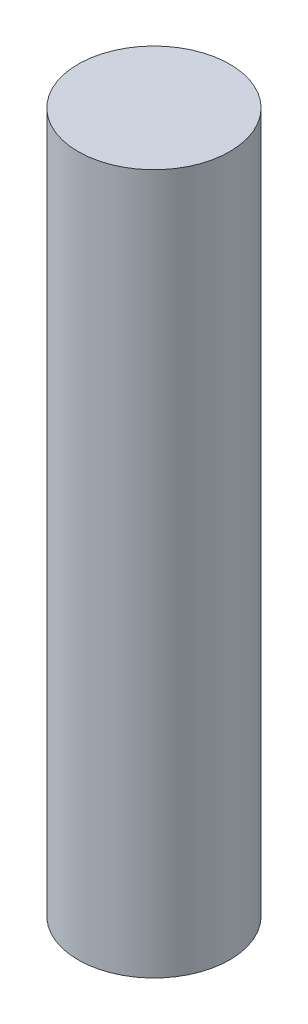
ISO-10303-21;
HEADER;
FILE_DESCRIPTION(('STEP AP214'),'2;1');
FILE_NAME('part.step','',(''),(''),'','','');
FILE_SCHEMA(('AUTOMOTIVE_DESIGN { 1 0 10303 214 1 1 1 1 }'));
ENDSEC;
DATA;
#1=APPLICATION_CONTEXT('core data for automotive mechanical design processes');
#2=APPLICATION_PROTOCOL_DEFINITION('international standard','automotive_design',2000,#1);
#3=PRODUCT_CONTEXT('',#1,'mechanical');
#4=PRODUCT('Part','Part','',(#3));
#5=PRODUCT_RELATED_PRODUCT_CATEGORY('part','',(#4));
#6=PRODUCT_DEFINITION_FORMATION('','',#4);
#7=PRODUCT_DEFINITION_CONTEXT('part definition',#1,'design');
#8=PRODUCT_DEFINITION('design','',#6,#7);
#9=PRODUCT_DEFINITION_SHAPE('','',#8);
#10=(LENGTH_UNIT() NAMED_UNIT(*) SI_UNIT(.MILLI.,.METRE.));
#11=(NAMED_UNIT(*) PLANE_ANGLE_UNIT() SI_UNIT($,.RADIAN.));
#12=(NAMED_UNIT(*) SI_UNIT($,.STERADIAN.) SOLID_ANGLE_UNIT());
#13=UNCERTAINTY_MEASURE_WITH_UNIT(LENGTH_MEASURE(1.E-05),#10,'distance_accuracy_value','');
#14=(GEOMETRIC_REPRESENTATION_CONTEXT(3) GLOBAL_UNCERTAINTY_ASSIGNED_CONTEXT((#13)) GLOBAL_UNIT_ASSIGNED_CONTEXT((#10,
#11,#12)) REPRESENTATION_CONTEXT('',''));
#15=CARTESIAN_POINT('',(0.,0.,0.));
#16=DIRECTION('',(0.,0.,1.));
#17=DIRECTION('',(1.,0.,0.));
#18=AXIS2_PLACEMENT_3D('',#15,#16,#17);
#19=CARTESIAN_POINT('',(0.,25.4,0.));
#20=DIRECTION('',(0.,-1.,0.));
#21=DIRECTION('',(0.,0.,-1.));
#22=AXIS2_PLACEMENT_3D('',#19,#20,#21);
#23=CYLINDRICAL_SURFACE('',#22,2.75);
#24=CARTESIAN_POINT('',(0.,25.4,0.));
#25=DIRECTION('',(0.,1.,0.));
#26=DIRECTION('',(0.,0.,1.));
#27=AXIS2_PLACEMENT_3D('',#24,#25,#26);
#28=CIRCLE('',#27,2.75);
#29=CARTESIAN_POINT('',(0.,25.4,2.75));
#30=VERTEX_POINT('',#29);
#31=EDGE_CURVE('E10',#30,#30,#28,.T.);
#32=ORIENTED_EDGE('',*,*,#31,.F.);
#33=EDGE_LOOP('',(#32));
#34=FACE_BOUND('',#33,.T.);
#35=CARTESIAN_POINT('',(0.,0.,0.));
#36=DIRECTION('',(0.,1.,0.));
#37=DIRECTION('',(0.,0.,1.));
#38=AXIS2_PLACEMENT_3D('',#35,#36,#37);
#39=CIRCLE('',#38,2.75);
#40=CARTESIAN_POINT('',(0.,0.,2.75));
#41=VERTEX_POINT('',#40);
#42=EDGE_CURVE('E38',#41,#41,#39,.T.);
#43=ORIENTED_EDGE('',*,*,#42,.T.);
#44=EDGE_LOOP('',(#43));
#45=FACE_BOUND('',#44,.T.);
#46=ADVANCED_FACE('F35',(#34,#45),#23,.T.);
#47=CARTESIAN_POINT('',(0.,25.4,0.));
#48=DIRECTION('',(0.,1.,0.));
#49=DIRECTION('',(0.,0.,1.));
#50=AXIS2_PLACEMENT_3D('',#47,#48,#49);
#51=PLANE('',#50);
#52=ORIENTED_EDGE('',*,*,#31,.T.);
#53=EDGE_LOOP('',(#52));
#54=FACE_BOUND('',#53,.T.);
#55=ADVANCED_FACE('F50',(#54),#51,.T.);
#56=CARTESIAN_POINT('',(0.,0.,0.));
#57=DIRECTION('',(0.,1.,0.));
#58=DIRECTION('',(0.,0.,1.));
#59=AXIS2_PLACEMENT_3D('',#56,#57,#58);
#60=PLANE('',#59);
#61=ORIENTED_EDGE('',*,*,#42,.F.);
#62=EDGE_LOOP('',(#61));
#63=FACE_BOUND('',#62,.T.);
#64=ADVANCED_FACE('F48',(#63),#60,.F.);
#65=CLOSED_SHELL('',(#46,#55,#64));
#66=MANIFOLD_SOLID_BREP('B2',#65);
#67=ADVANCED_BREP_SHAPE_REPRESENTATION('',(#18,#66),#14);
#68=SHAPE_DEFINITION_REPRESENTATION(#9,#67);
ENDSEC;
END-ISO-10303-21;
